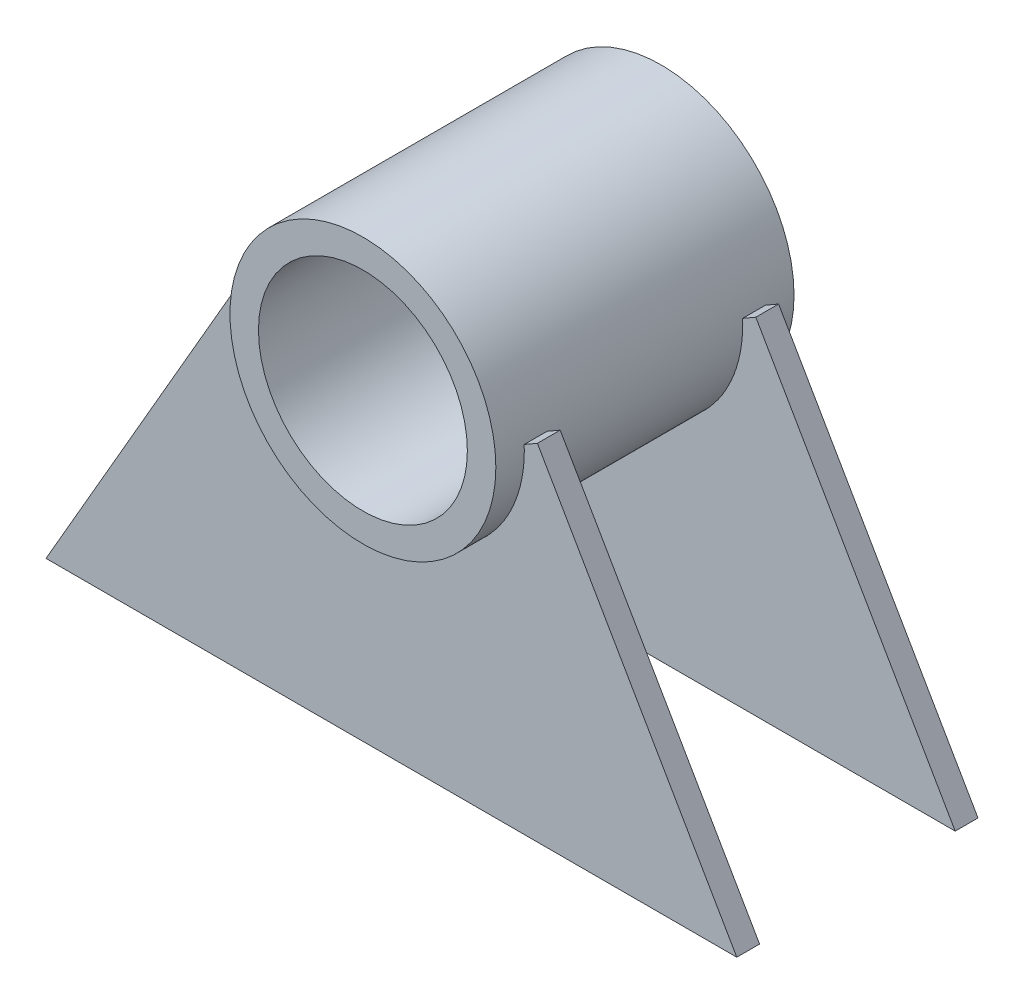
ISO-10303-21;
HEADER;
FILE_DESCRIPTION(('STEP AP214'),'2;1');
FILE_NAME('part.step','',(''),(''),'','','');
FILE_SCHEMA(('AUTOMOTIVE_DESIGN { 1 0 10303 214 1 1 1 1 }'));
ENDSEC;
DATA;
#1=APPLICATION_CONTEXT('core data for automotive mechanical design processes');
#2=APPLICATION_PROTOCOL_DEFINITION('international standard','automotive_design',2000,#1);
#3=PRODUCT_CONTEXT('',#1,'mechanical');
#4=PRODUCT('Part','Part','',(#3));
#5=PRODUCT_RELATED_PRODUCT_CATEGORY('part','',(#4));
#6=PRODUCT_DEFINITION_FORMATION('','',#4);
#7=PRODUCT_DEFINITION_CONTEXT('part definition',#1,'design');
#8=PRODUCT_DEFINITION('design','',#6,#7);
#9=PRODUCT_DEFINITION_SHAPE('','',#8);
#10=(LENGTH_UNIT() NAMED_UNIT(*) SI_UNIT(.MILLI.,.METRE.));
#11=(NAMED_UNIT(*) PLANE_ANGLE_UNIT() SI_UNIT($,.RADIAN.));
#12=(NAMED_UNIT(*) SI_UNIT($,.STERADIAN.) SOLID_ANGLE_UNIT());
#13=UNCERTAINTY_MEASURE_WITH_UNIT(LENGTH_MEASURE(1.E-05),#10,'distance_accuracy_value','');
#14=(GEOMETRIC_REPRESENTATION_CONTEXT(3) GLOBAL_UNCERTAINTY_ASSIGNED_CONTEXT((#13)) GLOBAL_UNIT_ASSIGNED_CONTEXT((#10,
#11,#12)) REPRESENTATION_CONTEXT('',''));
#15=CARTESIAN_POINT('',(0.,0.,0.));
#16=DIRECTION('',(0.,0.,1.));
#17=DIRECTION('',(1.,0.,0.));
#18=AXIS2_PLACEMENT_3D('',#15,#16,#17);
#19=CARTESIAN_POINT('',(-36.3730669589463,-35.,-10.3));
#20=DIRECTION('',(0.86602540378444,-0.499999999999998,0.));
#21=DIRECTION('',(0.499999999999998,0.86602540378444,0.));
#22=AXIS2_PLACEMENT_3D('',#19,#20,#21);
#23=PLANE('',#22);
#24=DIRECTION('',(-0.499999999999998,-0.86602540378444,0.));
#25=VECTOR('',#24,1.);
#26=CARTESIAN_POINT('',(-36.3730669589463,-35.,-12.7));
#27=LINE('',#26,#25);
#28=CARTESIAN_POINT('',(-15.3739710148365,1.37150108821183,-12.7));
#29=VERTEX_POINT('',#28);
#30=CARTESIAN_POINT('',(-36.3730669589463,-35.,-12.7));
#31=VERTEX_POINT('',#30);
#32=EDGE_CURVE('E127',#29,#31,#27,.T.);
#33=ORIENTED_EDGE('',*,*,#32,.T.);
#34=DIRECTION('',(0.,0.,-1.));
#35=VECTOR('',#34,1.);
#36=CARTESIAN_POINT('',(-36.3730669589463,-35.,-10.3));
#37=LINE('',#36,#35);
#38=CARTESIAN_POINT('',(-36.3730669589463,-35.,-10.3));
#39=VERTEX_POINT('',#38);
#40=EDGE_CURVE('E12',#39,#31,#37,.T.);
#41=ORIENTED_EDGE('',*,*,#40,.F.);
#42=DIRECTION('',(-0.499999999999998,-0.86602540378444,0.));
#43=VECTOR('',#42,1.);
#44=CARTESIAN_POINT('',(-36.3730669589463,-35.,-10.3));
#45=LINE('',#44,#43);
#46=CARTESIAN_POINT('',(-15.3739710148365,1.37150108821183,-10.3));
#47=VERTEX_POINT('',#46);
#48=EDGE_CURVE('E137',#47,#39,#45,.T.);
#49=ORIENTED_EDGE('',*,*,#48,.F.);
#50=DIRECTION('',(0.,0.,-1.));
#51=VECTOR('',#50,1.);
#52=CARTESIAN_POINT('',(-15.3739710148365,1.37150108821183,-10.3));
#53=LINE('',#52,#51);
#54=EDGE_CURVE('E123',#47,#29,#53,.T.);
#55=ORIENTED_EDGE('',*,*,#54,.T.);
#56=EDGE_LOOP('',(#33,#41,#49,#55));
#57=FACE_BOUND('',#56,.T.);
#58=ADVANCED_FACE('F43',(#57),#23,.F.);
#59=CARTESIAN_POINT('',(-36.3730669589463,-35.,-10.3));
#60=DIRECTION('',(0.,1.,0.));
#61=DIRECTION('',(-1.,0.,0.));
#62=AXIS2_PLACEMENT_3D('',#59,#60,#61);
#63=PLANE('',#62);
#64=DIRECTION('',(1.,0.,0.));
#65=VECTOR('',#64,1.);
#66=CARTESIAN_POINT('',(-36.3730669589463,-35.,-12.7));
#67=LINE('',#66,#65);
#68=CARTESIAN_POINT('',(36.3730669589463,-35.,-12.7));
#69=VERTEX_POINT('',#68);
#70=EDGE_CURVE('E130',#31,#69,#67,.T.);
#71=ORIENTED_EDGE('',*,*,#70,.T.);
#72=DIRECTION('',(0.,0.,-1.));
#73=VECTOR('',#72,1.);
#74=CARTESIAN_POINT('',(36.3730669589463,-35.,-10.3));
#75=LINE('',#74,#73);
#76=CARTESIAN_POINT('',(36.3730669589463,-35.,-10.3));
#77=VERTEX_POINT('',#76);
#78=EDGE_CURVE('E51',#77,#69,#75,.T.);
#79=ORIENTED_EDGE('',*,*,#78,.F.);
#80=DIRECTION('',(1.,0.,0.));
#81=VECTOR('',#80,1.);
#82=CARTESIAN_POINT('',(-36.3730669589463,-35.,-10.3));
#83=LINE('',#82,#81);
#84=EDGE_CURVE('E96',#39,#77,#83,.T.);
#85=ORIENTED_EDGE('',*,*,#84,.F.);
#86=ORIENTED_EDGE('',*,*,#40,.T.);
#87=EDGE_LOOP('',(#71,#79,#85,#86));
#88=FACE_BOUND('',#87,.T.);
#89=ADVANCED_FACE('F161',(#88),#63,.F.);
#90=CARTESIAN_POINT('',(36.3730669589463,-35.,-10.3));
#91=DIRECTION('',(-0.86602540378444,-0.499999999999998,0.));
#92=DIRECTION('',(0.499999999999998,-0.86602540378444,0.));
#93=AXIS2_PLACEMENT_3D('',#90,#91,#92);
#94=PLANE('',#93);
#95=DIRECTION('',(-0.499999999999998,0.86602540378444,0.));
#96=VECTOR('',#95,1.);
#97=CARTESIAN_POINT('',(36.3730669589463,-35.,-12.7));
#98=LINE('',#97,#96);
#99=CARTESIAN_POINT('',(15.3739710148365,1.37150108821187,-12.7));
#100=VERTEX_POINT('',#99);
#101=EDGE_CURVE('E132',#69,#100,#98,.T.);
#102=ORIENTED_EDGE('',*,*,#101,.T.);
#103=DIRECTION('',(0.,0.,-1.));
#104=VECTOR('',#103,1.);
#105=CARTESIAN_POINT('',(15.3739710148365,1.37150108821187,-10.3));
#106=LINE('',#105,#104);
#107=CARTESIAN_POINT('',(15.3739710148365,1.37150108821187,-10.3));
#108=VERTEX_POINT('',#107);
#109=EDGE_CURVE('E118',#108,#100,#106,.T.);
#110=ORIENTED_EDGE('',*,*,#109,.F.);
#111=DIRECTION('',(-0.499999999999998,0.86602540378444,0.));
#112=VECTOR('',#111,1.);
#113=CARTESIAN_POINT('',(36.3730669589463,-35.,-10.3));
#114=LINE('',#113,#112);
#115=EDGE_CURVE('E109',#77,#108,#114,.T.);
#116=ORIENTED_EDGE('',*,*,#115,.F.);
#117=ORIENTED_EDGE('',*,*,#78,.T.);
#118=EDGE_LOOP('',(#102,#110,#116,#117));
#119=FACE_BOUND('',#118,.T.);
#120=ADVANCED_FACE('F143',(#119),#94,.F.);
#121=CARTESIAN_POINT('',(15.3739710148365,1.37150108821187,-10.3));
#122=DIRECTION('',(0.499999999999998,-0.86602540378444,0.));
#123=DIRECTION('',(0.86602540378444,0.499999999999998,0.));
#124=AXIS2_PLACEMENT_3D('',#121,#122,#123);
#125=PLANE('',#124);
#126=DIRECTION('',(-0.86602540378444,-0.499999999999998,0.));
#127=VECTOR('',#126,1.);
#128=CARTESIAN_POINT('',(15.3739710148365,1.37150108821187,-12.7));
#129=LINE('',#128,#127);
#130=CARTESIAN_POINT('',(13.9883303687814,0.571501088211869,-12.7));
#131=VERTEX_POINT('',#130);
#132=EDGE_CURVE('E117',#100,#131,#129,.T.);
#133=ORIENTED_EDGE('',*,*,#132,.T.);
#134=DIRECTION('',(0.,0.,-1.));
#135=VECTOR('',#134,1.);
#136=CARTESIAN_POINT('',(13.9883303687814,0.571501088211869,-10.3));
#137=LINE('',#136,#135);
#138=CARTESIAN_POINT('',(13.9883303687814,0.571501088211869,-10.3));
#139=VERTEX_POINT('',#138);
#140=EDGE_CURVE('E114',#139,#131,#137,.T.);
#141=ORIENTED_EDGE('',*,*,#140,.F.);
#142=DIRECTION('',(-0.86602540378444,-0.499999999999998,0.));
#143=VECTOR('',#142,1.);
#144=CARTESIAN_POINT('',(15.3739710148365,1.37150108821187,-10.3));
#145=LINE('',#144,#143);
#146=EDGE_CURVE('E103',#108,#139,#145,.T.);
#147=ORIENTED_EDGE('',*,*,#146,.F.);
#148=ORIENTED_EDGE('',*,*,#109,.T.);
#149=EDGE_LOOP('',(#133,#141,#147,#148));
#150=FACE_BOUND('',#149,.T.);
#151=ADVANCED_FACE('F115',(#150),#125,.F.);
#152=CARTESIAN_POINT('',(0.,0.,-10.3));
#153=DIRECTION('',(0.,0.,-1.));
#154=DIRECTION('',(-1.,0.,0.));
#155=AXIS2_PLACEMENT_3D('',#152,#153,#154);
#156=CYLINDRICAL_SURFACE('',#155,14.);
#157=CARTESIAN_POINT('',(0.,0.,-12.7));
#158=DIRECTION('',(0.,0.,-1.));
#159=DIRECTION('',(1.,0.,0.));
#160=AXIS2_PLACEMENT_3D('',#157,#158,#159);
#161=CIRCLE('',#160,14.);
#162=CARTESIAN_POINT('',(-13.9883303687814,0.571501088211832,-12.7));
#163=VERTEX_POINT('',#162);
#164=EDGE_CURVE('E82',#131,#163,#161,.T.);
#165=ORIENTED_EDGE('',*,*,#164,.T.);
#166=DIRECTION('',(0.,0.,-1.));
#167=VECTOR('',#166,1.);
#168=CARTESIAN_POINT('',(-13.9883303687814,0.571501088211832,-10.3));
#169=LINE('',#168,#167);
#170=CARTESIAN_POINT('',(-13.9883303687814,0.571501088211832,-10.3));
#171=VERTEX_POINT('',#170);
#172=EDGE_CURVE('E119',#171,#163,#169,.T.);
#173=ORIENTED_EDGE('',*,*,#172,.F.);
#174=CARTESIAN_POINT('',(0.,0.,-10.3));
#175=DIRECTION('',(0.,0.,-1.));
#176=DIRECTION('',(1.,0.,0.));
#177=AXIS2_PLACEMENT_3D('',#174,#175,#176);
#178=CIRCLE('',#177,14.);
#179=EDGE_CURVE('E107',#139,#171,#178,.T.);
#180=ORIENTED_EDGE('',*,*,#179,.F.);
#181=ORIENTED_EDGE('',*,*,#140,.T.);
#182=EDGE_LOOP('',(#165,#173,#180,#181));
#183=FACE_BOUND('',#182,.T.);
#184=ADVANCED_FACE('F121',(#183),#156,.F.);
#185=CARTESIAN_POINT('',(-15.3739710148365,1.37150108821183,-10.3));
#186=DIRECTION('',(-0.499999999999998,-0.86602540378444,0.));
#187=DIRECTION('',(0.86602540378444,-0.499999999999998,0.));
#188=AXIS2_PLACEMENT_3D('',#185,#186,#187);
#189=PLANE('',#188);
#190=DIRECTION('',(-0.86602540378444,0.499999999999998,0.));
#191=VECTOR('',#190,1.);
#192=CARTESIAN_POINT('',(-15.3739710148365,1.37150108821183,-12.7));
#193=LINE('',#192,#191);
#194=EDGE_CURVE('E88',#163,#29,#193,.T.);
#195=ORIENTED_EDGE('',*,*,#194,.T.);
#196=ORIENTED_EDGE('',*,*,#54,.F.);
#197=DIRECTION('',(-0.86602540378444,0.499999999999998,0.));
#198=VECTOR('',#197,1.);
#199=CARTESIAN_POINT('',(-15.3739710148365,1.37150108821183,-10.3));
#200=LINE('',#199,#198);
#201=EDGE_CURVE('E59',#171,#47,#200,.T.);
#202=ORIENTED_EDGE('',*,*,#201,.F.);
#203=ORIENTED_EDGE('',*,*,#172,.T.);
#204=EDGE_LOOP('',(#195,#196,#202,#203));
#205=FACE_BOUND('',#204,.T.);
#206=ADVANCED_FACE('F150',(#205),#189,.F.);
#207=CARTESIAN_POINT('',(0.,0.,-10.3));
#208=DIRECTION('',(0.,0.,1.));
#209=DIRECTION('',(1.,0.,0.));
#210=AXIS2_PLACEMENT_3D('',#207,#208,#209);
#211=PLANE('',#210);
#212=ORIENTED_EDGE('',*,*,#48,.T.);
#213=ORIENTED_EDGE('',*,*,#84,.T.);
#214=ORIENTED_EDGE('',*,*,#115,.T.);
#215=ORIENTED_EDGE('',*,*,#146,.T.);
#216=ORIENTED_EDGE('',*,*,#179,.T.);
#217=ORIENTED_EDGE('',*,*,#201,.T.);
#218=EDGE_LOOP('',(#212,#213,#214,#215,#216,#217));
#219=FACE_BOUND('',#218,.T.);
#220=ADVANCED_FACE('F105',(#219),#211,.T.);
#221=CARTESIAN_POINT('',(0.,0.,-12.7));
#222=DIRECTION('',(0.,0.,1.));
#223=DIRECTION('',(1.,0.,0.));
#224=AXIS2_PLACEMENT_3D('',#221,#222,#223);
#225=PLANE('',#224);
#226=ORIENTED_EDGE('',*,*,#32,.F.);
#227=ORIENTED_EDGE('',*,*,#194,.F.);
#228=ORIENTED_EDGE('',*,*,#164,.F.);
#229=ORIENTED_EDGE('',*,*,#132,.F.);
#230=ORIENTED_EDGE('',*,*,#101,.F.);
#231=ORIENTED_EDGE('',*,*,#70,.F.);
#232=EDGE_LOOP('',(#226,#227,#228,#229,#230,#231));
#233=FACE_BOUND('',#232,.T.);
#234=ADVANCED_FACE('F146',(#233),#225,.F.);
#235=CLOSED_SHELL('',(#58,#89,#120,#151,#184,#206,#220,#234));
#236=MANIFOLD_SOLID_BREP('B2',#235);
#237=CARTESIAN_POINT('',(-36.3730669589463,-35.,10.3));
#238=DIRECTION('',(-0.86602540378444,0.499999999999998,0.));
#239=DIRECTION('',(-0.499999999999998,-0.86602540378444,0.));
#240=AXIS2_PLACEMENT_3D('',#237,#238,#239);
#241=PLANE('',#240);
#242=DIRECTION('',(-0.499999999999998,-0.86602540378444,0.));
#243=VECTOR('',#242,1.);
#244=CARTESIAN_POINT('',(-36.3730669589463,-35.,12.7));
#245=LINE('',#244,#243);
#246=CARTESIAN_POINT('',(-15.3739710148365,1.37150108821183,12.7));
#247=VERTEX_POINT('',#246);
#248=CARTESIAN_POINT('',(-36.3730669589463,-35.,12.7));
#249=VERTEX_POINT('',#248);
#250=EDGE_CURVE('E310',#247,#249,#245,.T.);
#251=ORIENTED_EDGE('',*,*,#250,.F.);
#252=DIRECTION('',(0.,0.,1.));
#253=VECTOR('',#252,1.);
#254=CARTESIAN_POINT('',(-15.3739710148365,1.37150108821183,10.3));
#255=LINE('',#254,#253);
#256=CARTESIAN_POINT('',(-15.3739710148365,1.37150108821183,10.3));
#257=VERTEX_POINT('',#256);
#258=EDGE_CURVE('E41',#257,#247,#255,.T.);
#259=ORIENTED_EDGE('',*,*,#258,.F.);
#260=DIRECTION('',(-0.499999999999998,-0.86602540378444,0.));
#261=VECTOR('',#260,1.);
#262=CARTESIAN_POINT('',(-36.3730669589463,-35.,10.3));
#263=LINE('',#262,#261);
#264=CARTESIAN_POINT('',(-36.3730669589463,-35.,10.3));
#265=VERTEX_POINT('',#264);
#266=EDGE_CURVE('E324',#257,#265,#263,.T.);
#267=ORIENTED_EDGE('',*,*,#266,.T.);
#268=DIRECTION('',(0.,0.,1.));
#269=VECTOR('',#268,1.);
#270=CARTESIAN_POINT('',(-36.3730669589463,-35.,10.3));
#271=LINE('',#270,#269);
#272=EDGE_CURVE('E228',#265,#249,#271,.T.);
#273=ORIENTED_EDGE('',*,*,#272,.T.);
#274=EDGE_LOOP('',(#251,#259,#267,#273));
#275=FACE_BOUND('',#274,.T.);
#276=ADVANCED_FACE('F225',(#275),#241,.T.);
#277=CARTESIAN_POINT('',(-15.3739710148365,1.37150108821183,10.3));
#278=DIRECTION('',(0.499999999999998,0.86602540378444,0.));
#279=DIRECTION('',(-0.86602540378444,0.499999999999998,0.));
#280=AXIS2_PLACEMENT_3D('',#277,#278,#279);
#281=PLANE('',#280);
#282=DIRECTION('',(-0.86602540378444,0.499999999999998,0.));
#283=VECTOR('',#282,1.);
#284=CARTESIAN_POINT('',(-15.3739710148365,1.37150108821183,12.7));
#285=LINE('',#284,#283);
#286=CARTESIAN_POINT('',(-13.9883303687814,0.571501088211832,12.7));
#287=VERTEX_POINT('',#286);
#288=EDGE_CURVE('E322',#287,#247,#285,.T.);
#289=ORIENTED_EDGE('',*,*,#288,.F.);
#290=DIRECTION('',(0.,0.,1.));
#291=VECTOR('',#290,1.);
#292=CARTESIAN_POINT('',(-13.9883303687814,0.571501088211832,10.3));
#293=LINE('',#292,#291);
#294=CARTESIAN_POINT('',(-13.9883303687814,0.571501088211832,10.3));
#295=VERTEX_POINT('',#294);
#296=EDGE_CURVE('E234',#295,#287,#293,.T.);
#297=ORIENTED_EDGE('',*,*,#296,.F.);
#298=DIRECTION('',(-0.86602540378444,0.499999999999998,0.));
#299=VECTOR('',#298,1.);
#300=CARTESIAN_POINT('',(-15.3739710148365,1.37150108821183,10.3));
#301=LINE('',#300,#299);
#302=EDGE_CURVE('E300',#295,#257,#301,.T.);
#303=ORIENTED_EDGE('',*,*,#302,.T.);
#304=ORIENTED_EDGE('',*,*,#258,.T.);
#305=EDGE_LOOP('',(#289,#297,#303,#304));
#306=FACE_BOUND('',#305,.T.);
#307=ADVANCED_FACE('F332',(#306),#281,.T.);
#308=CARTESIAN_POINT('',(0.,0.,10.3));
#309=DIRECTION('',(0.,0.,1.));
#310=DIRECTION('',(1.,0.,0.));
#311=AXIS2_PLACEMENT_3D('',#308,#309,#310);
#312=CYLINDRICAL_SURFACE('',#311,14.);
#313=CARTESIAN_POINT('',(0.,0.,12.7));
#314=DIRECTION('',(0.,0.,-1.));
#315=DIRECTION('',(1.,0.,0.));
#316=AXIS2_PLACEMENT_3D('',#313,#314,#315);
#317=CIRCLE('',#316,14.);
#318=CARTESIAN_POINT('',(13.9883303687814,0.571501088211869,12.7));
#319=VERTEX_POINT('',#318);
#320=EDGE_CURVE('E287',#319,#287,#317,.T.);
#321=ORIENTED_EDGE('',*,*,#320,.F.);
#322=DIRECTION('',(0.,0.,1.));
#323=VECTOR('',#322,1.);
#324=CARTESIAN_POINT('',(13.9883303687814,0.571501088211869,10.3));
#325=LINE('',#324,#323);
#326=CARTESIAN_POINT('',(13.9883303687814,0.571501088211869,10.3));
#327=VERTEX_POINT('',#326);
#328=EDGE_CURVE('E282',#327,#319,#325,.T.);
#329=ORIENTED_EDGE('',*,*,#328,.F.);
#330=CARTESIAN_POINT('',(0.,0.,10.3));
#331=DIRECTION('',(0.,0.,-1.));
#332=DIRECTION('',(1.,0.,0.));
#333=AXIS2_PLACEMENT_3D('',#330,#331,#332);
#334=CIRCLE('',#333,14.);
#335=EDGE_CURVE('E285',#327,#295,#334,.T.);
#336=ORIENTED_EDGE('',*,*,#335,.T.);
#337=ORIENTED_EDGE('',*,*,#296,.T.);
#338=EDGE_LOOP('',(#321,#329,#336,#337));
#339=FACE_BOUND('',#338,.T.);
#340=ADVANCED_FACE('F284',(#339),#312,.F.);
#341=CARTESIAN_POINT('',(15.3739710148365,1.37150108821187,10.3));
#342=DIRECTION('',(-0.499999999999998,0.86602540378444,0.));
#343=DIRECTION('',(-0.86602540378444,-0.499999999999998,0.));
#344=AXIS2_PLACEMENT_3D('',#341,#342,#343);
#345=PLANE('',#344);
#346=DIRECTION('',(-0.86602540378444,-0.499999999999998,0.));
#347=VECTOR('',#346,1.);
#348=CARTESIAN_POINT('',(15.3739710148365,1.37150108821187,12.7));
#349=LINE('',#348,#347);
#350=CARTESIAN_POINT('',(15.3739710148365,1.37150108821187,12.7));
#351=VERTEX_POINT('',#350);
#352=EDGE_CURVE('E319',#351,#319,#349,.T.);
#353=ORIENTED_EDGE('',*,*,#352,.F.);
#354=DIRECTION('',(0.,0.,1.));
#355=VECTOR('',#354,1.);
#356=CARTESIAN_POINT('',(15.3739710148365,1.37150108821187,10.3));
#357=LINE('',#356,#355);
#358=CARTESIAN_POINT('',(15.3739710148365,1.37150108821187,10.3));
#359=VERTEX_POINT('',#358);
#360=EDGE_CURVE('E292',#359,#351,#357,.T.);
#361=ORIENTED_EDGE('',*,*,#360,.F.);
#362=DIRECTION('',(-0.86602540378444,-0.499999999999998,0.));
#363=VECTOR('',#362,1.);
#364=CARTESIAN_POINT('',(15.3739710148365,1.37150108821187,10.3));
#365=LINE('',#364,#363);
#366=EDGE_CURVE('E298',#359,#327,#365,.T.);
#367=ORIENTED_EDGE('',*,*,#366,.T.);
#368=ORIENTED_EDGE('',*,*,#328,.T.);
#369=EDGE_LOOP('',(#353,#361,#367,#368));
#370=FACE_BOUND('',#369,.T.);
#371=ADVANCED_FACE('F302',(#370),#345,.T.);
#372=CARTESIAN_POINT('',(36.3730669589463,-35.,10.3));
#373=DIRECTION('',(0.86602540378444,0.499999999999998,0.));
#374=DIRECTION('',(-0.499999999999998,0.86602540378444,0.));
#375=AXIS2_PLACEMENT_3D('',#372,#373,#374);
#376=PLANE('',#375);
#377=DIRECTION('',(-0.499999999999998,0.86602540378444,0.));
#378=VECTOR('',#377,1.);
#379=CARTESIAN_POINT('',(36.3730669589463,-35.,12.7));
#380=LINE('',#379,#378);
#381=CARTESIAN_POINT('',(36.3730669589463,-35.,12.7));
#382=VERTEX_POINT('',#381);
#383=EDGE_CURVE('E316',#382,#351,#380,.T.);
#384=ORIENTED_EDGE('',*,*,#383,.F.);
#385=DIRECTION('',(0.,0.,1.));
#386=VECTOR('',#385,1.);
#387=CARTESIAN_POINT('',(36.3730669589463,-35.,10.3));
#388=LINE('',#387,#386);
#389=CARTESIAN_POINT('',(36.3730669589463,-35.,10.3));
#390=VERTEX_POINT('',#389);
#391=EDGE_CURVE('E327',#390,#382,#388,.T.);
#392=ORIENTED_EDGE('',*,*,#391,.F.);
#393=DIRECTION('',(-0.499999999999998,0.86602540378444,0.));
#394=VECTOR('',#393,1.);
#395=CARTESIAN_POINT('',(36.3730669589463,-35.,10.3));
#396=LINE('',#395,#394);
#397=EDGE_CURVE('E303',#390,#359,#396,.T.);
#398=ORIENTED_EDGE('',*,*,#397,.T.);
#399=ORIENTED_EDGE('',*,*,#360,.T.);
#400=EDGE_LOOP('',(#384,#392,#398,#399));
#401=FACE_BOUND('',#400,.T.);
#402=ADVANCED_FACE('F345',(#401),#376,.T.);
#403=CARTESIAN_POINT('',(-36.3730669589463,-35.,10.3));
#404=DIRECTION('',(0.,-1.,0.));
#405=DIRECTION('',(1.,0.,0.));
#406=AXIS2_PLACEMENT_3D('',#403,#404,#405);
#407=PLANE('',#406);
#408=DIRECTION('',(1.,0.,0.));
#409=VECTOR('',#408,1.);
#410=CARTESIAN_POINT('',(-36.3730669589463,-35.,12.7));
#411=LINE('',#410,#409);
#412=EDGE_CURVE('E313',#249,#382,#411,.T.);
#413=ORIENTED_EDGE('',*,*,#412,.F.);
#414=ORIENTED_EDGE('',*,*,#272,.F.);
#415=DIRECTION('',(1.,0.,0.));
#416=VECTOR('',#415,1.);
#417=CARTESIAN_POINT('',(-36.3730669589463,-35.,10.3));
#418=LINE('',#417,#416);
#419=EDGE_CURVE('E305',#265,#390,#418,.T.);
#420=ORIENTED_EDGE('',*,*,#419,.T.);
#421=ORIENTED_EDGE('',*,*,#391,.T.);
#422=EDGE_LOOP('',(#413,#414,#420,#421));
#423=FACE_BOUND('',#422,.T.);
#424=ADVANCED_FACE('F329',(#423),#407,.T.);
#425=CARTESIAN_POINT('',(0.,0.,10.3));
#426=DIRECTION('',(0.,0.,1.));
#427=DIRECTION('',(1.,0.,0.));
#428=AXIS2_PLACEMENT_3D('',#425,#426,#427);
#429=PLANE('',#428);
#430=ORIENTED_EDGE('',*,*,#266,.F.);
#431=ORIENTED_EDGE('',*,*,#302,.F.);
#432=ORIENTED_EDGE('',*,*,#335,.F.);
#433=ORIENTED_EDGE('',*,*,#366,.F.);
#434=ORIENTED_EDGE('',*,*,#397,.F.);
#435=ORIENTED_EDGE('',*,*,#419,.F.);
#436=EDGE_LOOP('',(#430,#431,#432,#433,#434,#435));
#437=FACE_BOUND('',#436,.T.);
#438=ADVANCED_FACE('F296',(#437),#429,.F.);
#439=CARTESIAN_POINT('',(0.,0.,12.7));
#440=DIRECTION('',(0.,0.,1.));
#441=DIRECTION('',(1.,0.,0.));
#442=AXIS2_PLACEMENT_3D('',#439,#440,#441);
#443=PLANE('',#442);
#444=ORIENTED_EDGE('',*,*,#250,.T.);
#445=ORIENTED_EDGE('',*,*,#412,.T.);
#446=ORIENTED_EDGE('',*,*,#383,.T.);
#447=ORIENTED_EDGE('',*,*,#352,.T.);
#448=ORIENTED_EDGE('',*,*,#320,.T.);
#449=ORIENTED_EDGE('',*,*,#288,.T.);
#450=EDGE_LOOP('',(#444,#445,#446,#447,#448,#449));
#451=FACE_BOUND('',#450,.T.);
#452=ADVANCED_FACE('F331',(#451),#443,.T.);
#453=CLOSED_SHELL('',(#276,#307,#340,#371,#402,#424,#438,#452));
#454=MANIFOLD_SOLID_BREP('B6',#453);
#455=CARTESIAN_POINT('',(0.,0.,-15.7));
#456=DIRECTION('',(0.,0.,1.));
#457=DIRECTION('',(1.,0.,0.));
#458=AXIS2_PLACEMENT_3D('',#455,#456,#457);
#459=CYLINDRICAL_SURFACE('',#458,14.);
#460=CARTESIAN_POINT('',(0.,0.,-15.7));
#461=DIRECTION('',(0.,0.,1.));
#462=DIRECTION('',(1.,0.,0.));
#463=AXIS2_PLACEMENT_3D('',#460,#461,#462);
#464=CIRCLE('',#463,14.);
#465=CARTESIAN_POINT('',(14.,0.,-15.7));
#466=VERTEX_POINT('',#465);
#467=EDGE_CURVE('E224',#466,#466,#464,.T.);
#468=ORIENTED_EDGE('',*,*,#467,.T.);
#469=EDGE_LOOP('',(#468));
#470=FACE_BOUND('',#469,.T.);
#471=CARTESIAN_POINT('',(0.,0.,15.7));
#472=DIRECTION('',(0.,0.,1.));
#473=DIRECTION('',(1.,0.,0.));
#474=AXIS2_PLACEMENT_3D('',#471,#472,#473);
#475=CIRCLE('',#474,14.);
#476=CARTESIAN_POINT('',(14.,0.,15.7));
#477=VERTEX_POINT('',#476);
#478=EDGE_CURVE('E410',#477,#477,#475,.T.);
#479=ORIENTED_EDGE('',*,*,#478,.F.);
#480=EDGE_LOOP('',(#479));
#481=FACE_BOUND('',#480,.T.);
#482=ADVANCED_FACE('F400',(#470,#481),#459,.T.);
#483=CARTESIAN_POINT('',(0.,0.,-15.7));
#484=DIRECTION('',(0.,0.,1.));
#485=DIRECTION('',(1.,0.,0.));
#486=AXIS2_PLACEMENT_3D('',#483,#484,#485);
#487=PLANE('',#486);
#488=CARTESIAN_POINT('',(0.,0.,-15.7));
#489=DIRECTION('',(0.,0.,1.));
#490=DIRECTION('',(1.,0.,0.));
#491=AXIS2_PLACEMENT_3D('',#488,#489,#490);
#492=CIRCLE('',#491,11.);
#493=CARTESIAN_POINT('',(11.,0.,-15.7));
#494=VERTEX_POINT('',#493);
#495=EDGE_CURVE('E406',#494,#494,#492,.T.);
#496=ORIENTED_EDGE('',*,*,#495,.T.);
#497=EDGE_LOOP('',(#496));
#498=FACE_BOUND('',#497,.T.);
#499=ORIENTED_EDGE('',*,*,#467,.F.);
#500=EDGE_LOOP('',(#499));
#501=FACE_BOUND('',#500,.T.);
#502=ADVANCED_FACE('F429',(#498,#501),#487,.F.);
#503=CARTESIAN_POINT('',(0.,0.,-15.7));
#504=DIRECTION('',(0.,0.,1.));
#505=DIRECTION('',(1.,0.,0.));
#506=AXIS2_PLACEMENT_3D('',#503,#504,#505);
#507=CYLINDRICAL_SURFACE('',#506,11.);
#508=ORIENTED_EDGE('',*,*,#495,.F.);
#509=EDGE_LOOP('',(#508));
#510=FACE_BOUND('',#509,.T.);
#511=CARTESIAN_POINT('',(0.,0.,15.7));
#512=DIRECTION('',(0.,0.,1.));
#513=DIRECTION('',(1.,0.,0.));
#514=AXIS2_PLACEMENT_3D('',#511,#512,#513);
#515=CIRCLE('',#514,11.);
#516=CARTESIAN_POINT('',(11.,0.,15.7));
#517=VERTEX_POINT('',#516);
#518=EDGE_CURVE('E414',#517,#517,#515,.T.);
#519=ORIENTED_EDGE('',*,*,#518,.T.);
#520=EDGE_LOOP('',(#519));
#521=FACE_BOUND('',#520,.T.);
#522=ADVANCED_FACE('F420',(#510,#521),#507,.F.);
#523=CARTESIAN_POINT('',(0.,0.,15.7));
#524=DIRECTION('',(0.,0.,1.));
#525=DIRECTION('',(1.,0.,0.));
#526=AXIS2_PLACEMENT_3D('',#523,#524,#525);
#527=PLANE('',#526);
#528=ORIENTED_EDGE('',*,*,#478,.T.);
#529=EDGE_LOOP('',(#528));
#530=FACE_BOUND('',#529,.T.);
#531=ORIENTED_EDGE('',*,*,#518,.F.);
#532=EDGE_LOOP('',(#531));
#533=FACE_BOUND('',#532,.T.);
#534=ADVANCED_FACE('F422',(#530,#533),#527,.T.);
#535=CLOSED_SHELL('',(#482,#502,#522,#534));
#536=MANIFOLD_SOLID_BREP('B35',#535);
#537=ADVANCED_BREP_SHAPE_REPRESENTATION('',(#18,#236,#454,#536),#14);
#538=SHAPE_DEFINITION_REPRESENTATION(#9,#537);
ENDSEC;
END-ISO-10303-21;
